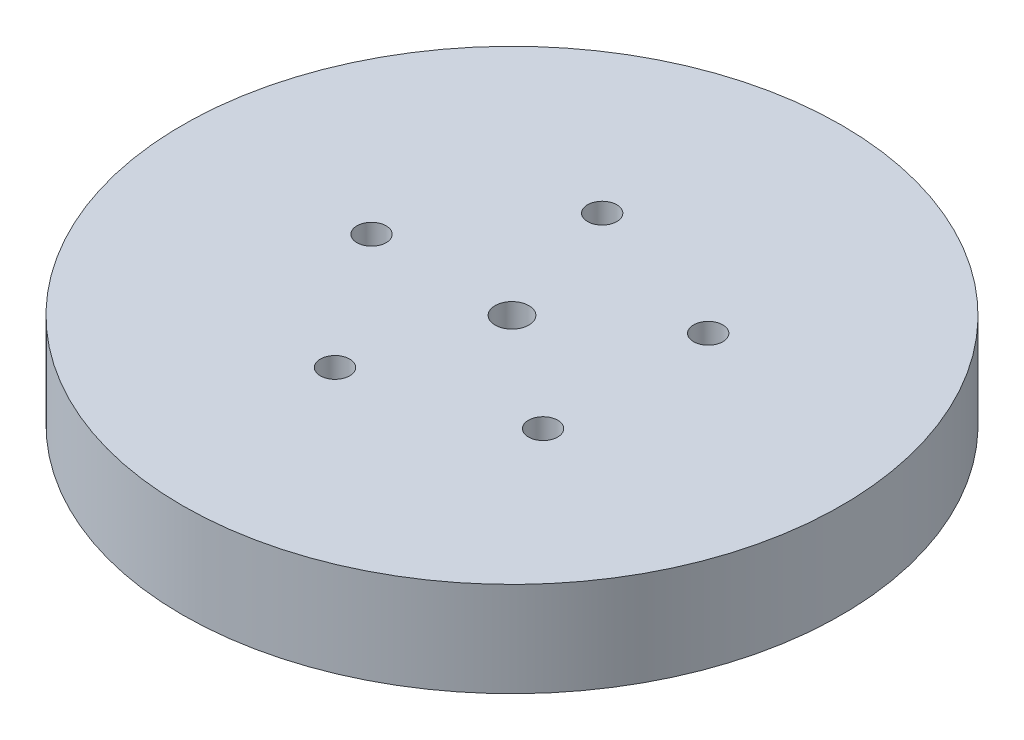
ISO-10303-21;
HEADER;
FILE_DESCRIPTION(('STEP AP214'),'2;1');
FILE_NAME('part.step','',(''),(''),'','','');
FILE_SCHEMA(('AUTOMOTIVE_DESIGN { 1 0 10303 214 1 1 1 1 }'));
ENDSEC;
DATA;
#1=APPLICATION_CONTEXT('core data for automotive mechanical design processes');
#2=APPLICATION_PROTOCOL_DEFINITION('international standard','automotive_design',2000,#1);
#3=PRODUCT_CONTEXT('',#1,'mechanical');
#4=PRODUCT('Part','Part','',(#3));
#5=PRODUCT_RELATED_PRODUCT_CATEGORY('part','',(#4));
#6=PRODUCT_DEFINITION_FORMATION('','',#4);
#7=PRODUCT_DEFINITION_CONTEXT('part definition',#1,'design');
#8=PRODUCT_DEFINITION('design','',#6,#7);
#9=PRODUCT_DEFINITION_SHAPE('','',#8);
#10=(LENGTH_UNIT() NAMED_UNIT(*) SI_UNIT(.MILLI.,.METRE.));
#11=(NAMED_UNIT(*) PLANE_ANGLE_UNIT() SI_UNIT($,.RADIAN.));
#12=(NAMED_UNIT(*) SI_UNIT($,.STERADIAN.) SOLID_ANGLE_UNIT());
#13=UNCERTAINTY_MEASURE_WITH_UNIT(LENGTH_MEASURE(1.E-05),#10,'distance_accuracy_value','');
#14=(GEOMETRIC_REPRESENTATION_CONTEXT(3) GLOBAL_UNCERTAINTY_ASSIGNED_CONTEXT((#13)) GLOBAL_UNIT_ASSIGNED_CONTEXT((#10,
#11,#12)) REPRESENTATION_CONTEXT('',''));
#15=CARTESIAN_POINT('',(0.,0.,0.));
#16=DIRECTION('',(0.,0.,1.));
#17=DIRECTION('',(1.,0.,0.));
#18=AXIS2_PLACEMENT_3D('',#15,#16,#17);
#19=CARTESIAN_POINT('',(0.,28.,0.));
#20=DIRECTION('',(0.,-1.,0.));
#21=DIRECTION('',(0.,0.,-1.));
#22=AXIS2_PLACEMENT_3D('',#19,#20,#21);
#23=CYLINDRICAL_SURFACE('',#22,97.5);
#24=CARTESIAN_POINT('',(0.,28.,0.));
#25=DIRECTION('',(0.,1.,0.));
#26=DIRECTION('',(0.,0.,1.));
#27=AXIS2_PLACEMENT_3D('',#24,#25,#26);
#28=CIRCLE('',#27,97.5);
#29=CARTESIAN_POINT('',(0.,28.,97.5));
#30=VERTEX_POINT('',#29);
#31=EDGE_CURVE('E10',#30,#30,#28,.T.);
#32=ORIENTED_EDGE('',*,*,#31,.F.);
#33=EDGE_LOOP('',(#32));
#34=FACE_BOUND('',#33,.T.);
#35=CARTESIAN_POINT('',(0.,0.,0.));
#36=DIRECTION('',(0.,1.,0.));
#37=DIRECTION('',(0.,0.,1.));
#38=AXIS2_PLACEMENT_3D('',#35,#36,#37);
#39=CIRCLE('',#38,97.5);
#40=CARTESIAN_POINT('',(0.,0.,97.5));
#41=VERTEX_POINT('',#40);
#42=EDGE_CURVE('E37',#41,#41,#39,.T.);
#43=ORIENTED_EDGE('',*,*,#42,.T.);
#44=EDGE_LOOP('',(#43));
#45=FACE_BOUND('',#44,.T.);
#46=ADVANCED_FACE('F40',(#34,#45),#23,.T.);
#47=CARTESIAN_POINT('',(0.,28.,0.));
#48=DIRECTION('',(0.,1.,0.));
#49=DIRECTION('',(0.,0.,1.));
#50=AXIS2_PLACEMENT_3D('',#47,#48,#49);
#51=PLANE('',#50);
#52=CARTESIAN_POINT('',(-12.841996811865,28.,39.5236021723345));
#53=DIRECTION('',(0.,1.,0.));
#54=DIRECTION('',(0.951056516295155,0.,0.309016994374945));
#55=AXIS2_PLACEMENT_3D('',#52,#53,#54);
#56=CIRCLE('',#55,4.32657298203613);
#57=CARTESIAN_POINT('',(-8.727181384073,28.,40.8605867511871));
#58=VERTEX_POINT('',#57);
#59=EDGE_CURVE('E78',#58,#58,#56,.T.);
#60=ORIENTED_EDGE('',*,*,#59,.F.);
#61=EDGE_LOOP('',(#60));
#62=FACE_BOUND('',#61,.T.);
#63=CARTESIAN_POINT('',(33.6207841368809,28.,24.4269295003317));
#64=DIRECTION('',(0.,1.,0.));
#65=DIRECTION('',(0.587785252292469,0.,-0.809016994374951));
#66=AXIS2_PLACEMENT_3D('',#63,#64,#65);
#67=CIRCLE('',#66,4.32657298203613);
#68=CARTESIAN_POINT('',(36.1638799286887,28.,20.9266584304609));
#69=VERTEX_POINT('',#68);
#70=EDGE_CURVE('E71',#69,#69,#67,.T.);
#71=ORIENTED_EDGE('',*,*,#70,.F.);
#72=EDGE_LOOP('',(#71));
#73=FACE_BOUND('',#72,.T.);
#74=CARTESIAN_POINT('',(33.6207841368805,28.,-24.4269295003322));
#75=DIRECTION('',(0.,1.,0.));
#76=DIRECTION('',(-0.58778525229248,0.,-0.809016994374942));
#77=AXIS2_PLACEMENT_3D('',#74,#75,#76);
#78=CIRCLE('',#77,4.32657298203613);
#79=CARTESIAN_POINT('',(31.0776883450726,28.,-27.9272005702029));
#80=VERTEX_POINT('',#79);
#81=EDGE_CURVE('E70',#80,#80,#78,.T.);
#82=ORIENTED_EDGE('',*,*,#81,.F.);
#83=EDGE_LOOP('',(#82));
#84=FACE_BOUND('',#83,.T.);
#85=CARTESIAN_POINT('',(-12.8419968118656,28.,-39.5236021723343));
#86=DIRECTION('',(0.,1.,0.));
#87=DIRECTION('',(-0.95105651629515,0.,0.309016994374958));
#88=AXIS2_PLACEMENT_3D('',#85,#86,#87);
#89=CIRCLE('',#88,4.32657298203613);
#90=CARTESIAN_POINT('',(-16.9568122396576,28.,-38.1866175934816));
#91=VERTEX_POINT('',#90);
#92=EDGE_CURVE('E61',#91,#91,#89,.T.);
#93=ORIENTED_EDGE('',*,*,#92,.F.);
#94=EDGE_LOOP('',(#93));
#95=FACE_BOUND('',#94,.T.);
#96=CARTESIAN_POINT('',(-41.5575746500312,28.,0.));
#97=DIRECTION('',(0.,1.,0.));
#98=DIRECTION('',(0.,0.,1.));
#99=AXIS2_PLACEMENT_3D('',#96,#97,#98);
#100=CIRCLE('',#99,4.32657298203613);
#101=CARTESIAN_POINT('',(-41.5575746500312,28.,4.32657298203613));
#102=VERTEX_POINT('',#101);
#103=EDGE_CURVE('E54',#102,#102,#100,.T.);
#104=ORIENTED_EDGE('',*,*,#103,.F.);
#105=EDGE_LOOP('',(#104));
#106=FACE_BOUND('',#105,.T.);
#107=CARTESIAN_POINT('',(0.,28.,0.));
#108=DIRECTION('',(0.,1.,0.));
#109=DIRECTION('',(0.,0.,1.));
#110=AXIS2_PLACEMENT_3D('',#107,#108,#109);
#111=CIRCLE('',#110,5.);
#112=CARTESIAN_POINT('',(0.,28.,5.));
#113=VERTEX_POINT('',#112);
#114=EDGE_CURVE('E50',#113,#113,#111,.T.);
#115=ORIENTED_EDGE('',*,*,#114,.F.);
#116=EDGE_LOOP('',(#115));
#117=FACE_BOUND('',#116,.T.);
#118=ORIENTED_EDGE('',*,*,#31,.T.);
#119=EDGE_LOOP('',(#118));
#120=FACE_BOUND('',#119,.T.);
#121=ADVANCED_FACE('F94',(#62,#73,#84,#95,#106,#117,#120),#51,.T.);
#122=CARTESIAN_POINT('',(0.,0.,0.));
#123=DIRECTION('',(0.,1.,0.));
#124=DIRECTION('',(0.,0.,1.));
#125=AXIS2_PLACEMENT_3D('',#122,#123,#124);
#126=PLANE('',#125);
#127=CARTESIAN_POINT('',(0.,0.,0.));
#128=DIRECTION('',(0.,1.,0.));
#129=DIRECTION('',(0.,0.,1.));
#130=AXIS2_PLACEMENT_3D('',#127,#128,#129);
#131=CIRCLE('',#130,5.);
#132=CARTESIAN_POINT('',(0.,0.,5.));
#133=VERTEX_POINT('',#132);
#134=EDGE_CURVE('E47',#133,#133,#131,.T.);
#135=ORIENTED_EDGE('',*,*,#134,.T.);
#136=EDGE_LOOP('',(#135));
#137=FACE_BOUND('',#136,.T.);
#138=ORIENTED_EDGE('',*,*,#42,.F.);
#139=EDGE_LOOP('',(#138));
#140=FACE_BOUND('',#139,.T.);
#141=ADVANCED_FACE('F100',(#137,#140),#126,.F.);
#142=CARTESIAN_POINT('',(0.,28.,0.));
#143=DIRECTION('',(0.,-1.,0.));
#144=DIRECTION('',(0.,0.,-1.));
#145=AXIS2_PLACEMENT_3D('',#142,#143,#144);
#146=CYLINDRICAL_SURFACE('',#145,5.);
#147=ORIENTED_EDGE('',*,*,#114,.T.);
#148=EDGE_LOOP('',(#147));
#149=FACE_BOUND('',#148,.T.);
#150=ORIENTED_EDGE('',*,*,#134,.F.);
#151=EDGE_LOOP('',(#150));
#152=FACE_BOUND('',#151,.T.);
#153=ADVANCED_FACE('F108',(#149,#152),#146,.F.);
#154=CARTESIAN_POINT('',(-41.5575746500312,11.1925777812146,0.));
#155=DIRECTION('',(0.,1.,0.));
#156=DIRECTION('',(0.,0.,1.));
#157=AXIS2_PLACEMENT_3D('',#154,#155,#156);
#158=CYLINDRICAL_SURFACE('',#157,4.32657298203613);
#159=CARTESIAN_POINT('',(-41.5575746500312,11.1925777812146,0.));
#160=DIRECTION('',(0.,1.,0.));
#161=DIRECTION('',(0.,0.,1.));
#162=AXIS2_PLACEMENT_3D('',#159,#160,#161);
#163=CIRCLE('',#162,4.32657298203613);
#164=CARTESIAN_POINT('',(-41.5575746500312,11.1925777812146,4.32657298203613));
#165=VERTEX_POINT('',#164);
#166=EDGE_CURVE('E55',#165,#165,#163,.T.);
#167=ORIENTED_EDGE('',*,*,#166,.F.);
#168=EDGE_LOOP('',(#167));
#169=FACE_BOUND('',#168,.T.);
#170=ORIENTED_EDGE('',*,*,#103,.T.);
#171=EDGE_LOOP('',(#170));
#172=FACE_BOUND('',#171,.T.);
#173=ADVANCED_FACE('F115',(#169,#172),#158,.F.);
#174=CARTESIAN_POINT('',(-41.5575746500312,11.1925777812146,0.));
#175=DIRECTION('',(0.,1.,0.));
#176=DIRECTION('',(0.,0.,1.));
#177=AXIS2_PLACEMENT_3D('',#174,#175,#176);
#178=PLANE('',#177);
#179=ORIENTED_EDGE('',*,*,#166,.T.);
#180=EDGE_LOOP('',(#179));
#181=FACE_BOUND('',#180,.T.);
#182=ADVANCED_FACE('F142',(#181),#178,.T.);
#183=CARTESIAN_POINT('',(-12.8419968118656,11.1925777812146,-39.5236021723343));
#184=DIRECTION('',(0.,1.,0.));
#185=DIRECTION('',(0.,0.,1.));
#186=AXIS2_PLACEMENT_3D('',#183,#184,#185);
#187=CYLINDRICAL_SURFACE('',#186,4.32657298203613);
#188=CARTESIAN_POINT('',(-12.8419968118656,11.1925777812146,-39.5236021723343));
#189=DIRECTION('',(0.,1.,0.));
#190=DIRECTION('',(-0.95105651629515,0.,0.309016994374958));
#191=AXIS2_PLACEMENT_3D('',#188,#189,#190);
#192=CIRCLE('',#191,4.32657298203613);
#193=CARTESIAN_POINT('',(-16.9568122396576,11.1925777812146,-38.1866175934816));
#194=VERTEX_POINT('',#193);
#195=EDGE_CURVE('E63',#194,#194,#192,.T.);
#196=ORIENTED_EDGE('',*,*,#195,.F.);
#197=EDGE_LOOP('',(#196));
#198=FACE_BOUND('',#197,.T.);
#199=ORIENTED_EDGE('',*,*,#92,.T.);
#200=EDGE_LOOP('',(#199));
#201=FACE_BOUND('',#200,.T.);
#202=ADVANCED_FACE('F147',(#198,#201),#187,.F.);
#203=CARTESIAN_POINT('',(-12.8419968118656,11.1925777812146,-39.5236021723343));
#204=DIRECTION('',(0.,1.,0.));
#205=DIRECTION('',(-0.95105651629515,0.,0.309016994374958));
#206=AXIS2_PLACEMENT_3D('',#203,#204,#205);
#207=PLANE('',#206);
#208=ORIENTED_EDGE('',*,*,#195,.T.);
#209=EDGE_LOOP('',(#208));
#210=FACE_BOUND('',#209,.T.);
#211=ADVANCED_FACE('F163',(#210),#207,.T.);
#212=CARTESIAN_POINT('',(33.6207841368805,11.1925777812146,-24.4269295003322));
#213=DIRECTION('',(0.,1.,0.));
#214=DIRECTION('',(0.,0.,1.));
#215=AXIS2_PLACEMENT_3D('',#212,#213,#214);
#216=CYLINDRICAL_SURFACE('',#215,4.32657298203613);
#217=CARTESIAN_POINT('',(33.6207841368805,11.1925777812146,-24.4269295003322));
#218=DIRECTION('',(0.,1.,0.));
#219=DIRECTION('',(-0.58778525229248,0.,-0.809016994374942));
#220=AXIS2_PLACEMENT_3D('',#217,#218,#219);
#221=CIRCLE('',#220,4.32657298203613);
#222=CARTESIAN_POINT('',(31.0776883450726,11.1925777812146,-27.9272005702029));
#223=VERTEX_POINT('',#222);
#224=EDGE_CURVE('E69',#223,#223,#221,.T.);
#225=ORIENTED_EDGE('',*,*,#224,.F.);
#226=EDGE_LOOP('',(#225));
#227=FACE_BOUND('',#226,.T.);
#228=ORIENTED_EDGE('',*,*,#81,.T.);
#229=EDGE_LOOP('',(#228));
#230=FACE_BOUND('',#229,.T.);
#231=ADVANCED_FACE('F172',(#227,#230),#216,.F.);
#232=CARTESIAN_POINT('',(33.6207841368805,11.1925777812146,-24.4269295003322));
#233=DIRECTION('',(0.,1.,0.));
#234=DIRECTION('',(-0.58778525229248,0.,-0.809016994374942));
#235=AXIS2_PLACEMENT_3D('',#232,#233,#234);
#236=PLANE('',#235);
#237=ORIENTED_EDGE('',*,*,#224,.T.);
#238=EDGE_LOOP('',(#237));
#239=FACE_BOUND('',#238,.T.);
#240=ADVANCED_FACE('F185',(#239),#236,.T.);
#241=CARTESIAN_POINT('',(33.6207841368809,11.1925777812146,24.4269295003317));
#242=DIRECTION('',(0.,1.,0.));
#243=DIRECTION('',(0.,0.,1.));
#244=AXIS2_PLACEMENT_3D('',#241,#242,#243);
#245=CYLINDRICAL_SURFACE('',#244,4.32657298203613);
#246=CARTESIAN_POINT('',(33.6207841368809,11.1925777812146,24.4269295003317));
#247=DIRECTION('',(0.,1.,0.));
#248=DIRECTION('',(0.587785252292469,0.,-0.809016994374951));
#249=AXIS2_PLACEMENT_3D('',#246,#247,#248);
#250=CIRCLE('',#249,4.32657298203613);
#251=CARTESIAN_POINT('',(36.1638799286887,11.1925777812146,20.9266584304609));
#252=VERTEX_POINT('',#251);
#253=EDGE_CURVE('E76',#252,#252,#250,.T.);
#254=ORIENTED_EDGE('',*,*,#253,.F.);
#255=EDGE_LOOP('',(#254));
#256=FACE_BOUND('',#255,.T.);
#257=ORIENTED_EDGE('',*,*,#70,.T.);
#258=EDGE_LOOP('',(#257));
#259=FACE_BOUND('',#258,.T.);
#260=ADVANCED_FACE('F191',(#256,#259),#245,.F.);
#261=CARTESIAN_POINT('',(33.6207841368809,11.1925777812146,24.4269295003317));
#262=DIRECTION('',(0.,1.,0.));
#263=DIRECTION('',(0.587785252292469,0.,-0.809016994374951));
#264=AXIS2_PLACEMENT_3D('',#261,#262,#263);
#265=PLANE('',#264);
#266=ORIENTED_EDGE('',*,*,#253,.T.);
#267=EDGE_LOOP('',(#266));
#268=FACE_BOUND('',#267,.T.);
#269=ADVANCED_FACE('F89',(#268),#265,.T.);
#270=CARTESIAN_POINT('',(-12.841996811865,11.1925777812146,39.5236021723345));
#271=DIRECTION('',(0.,1.,0.));
#272=DIRECTION('',(0.,0.,1.));
#273=AXIS2_PLACEMENT_3D('',#270,#271,#272);
#274=CYLINDRICAL_SURFACE('',#273,4.32657298203613);
#275=CARTESIAN_POINT('',(-12.841996811865,11.1925777812146,39.5236021723345));
#276=DIRECTION('',(0.,1.,0.));
#277=DIRECTION('',(0.951056516295155,0.,0.309016994374945));
#278=AXIS2_PLACEMENT_3D('',#275,#276,#277);
#279=CIRCLE('',#278,4.32657298203613);
#280=CARTESIAN_POINT('',(-8.727181384073,11.1925777812146,40.8605867511871));
#281=VERTEX_POINT('',#280);
#282=EDGE_CURVE('E59',#281,#281,#279,.T.);
#283=ORIENTED_EDGE('',*,*,#282,.F.);
#284=EDGE_LOOP('',(#283));
#285=FACE_BOUND('',#284,.T.);
#286=ORIENTED_EDGE('',*,*,#59,.T.);
#287=EDGE_LOOP('',(#286));
#288=FACE_BOUND('',#287,.T.);
#289=ADVANCED_FACE('F87',(#285,#288),#274,.F.);
#290=CARTESIAN_POINT('',(-12.841996811865,11.1925777812146,39.5236021723345));
#291=DIRECTION('',(0.,1.,0.));
#292=DIRECTION('',(0.951056516295155,0.,0.309016994374945));
#293=AXIS2_PLACEMENT_3D('',#290,#291,#292);
#294=PLANE('',#293);
#295=ORIENTED_EDGE('',*,*,#282,.T.);
#296=EDGE_LOOP('',(#295));
#297=FACE_BOUND('',#296,.T.);
#298=ADVANCED_FACE('F84',(#297),#294,.T.);
#299=CLOSED_SHELL('',(#46,#121,#141,#153,#173,#182,#202,#211,#231,#240,#260,#269,#289,#298));
#300=MANIFOLD_SOLID_BREP('B2',#299);
#301=ADVANCED_BREP_SHAPE_REPRESENTATION('',(#18,#300),#14);
#302=SHAPE_DEFINITION_REPRESENTATION(#9,#301);
ENDSEC;
END-ISO-10303-21;
